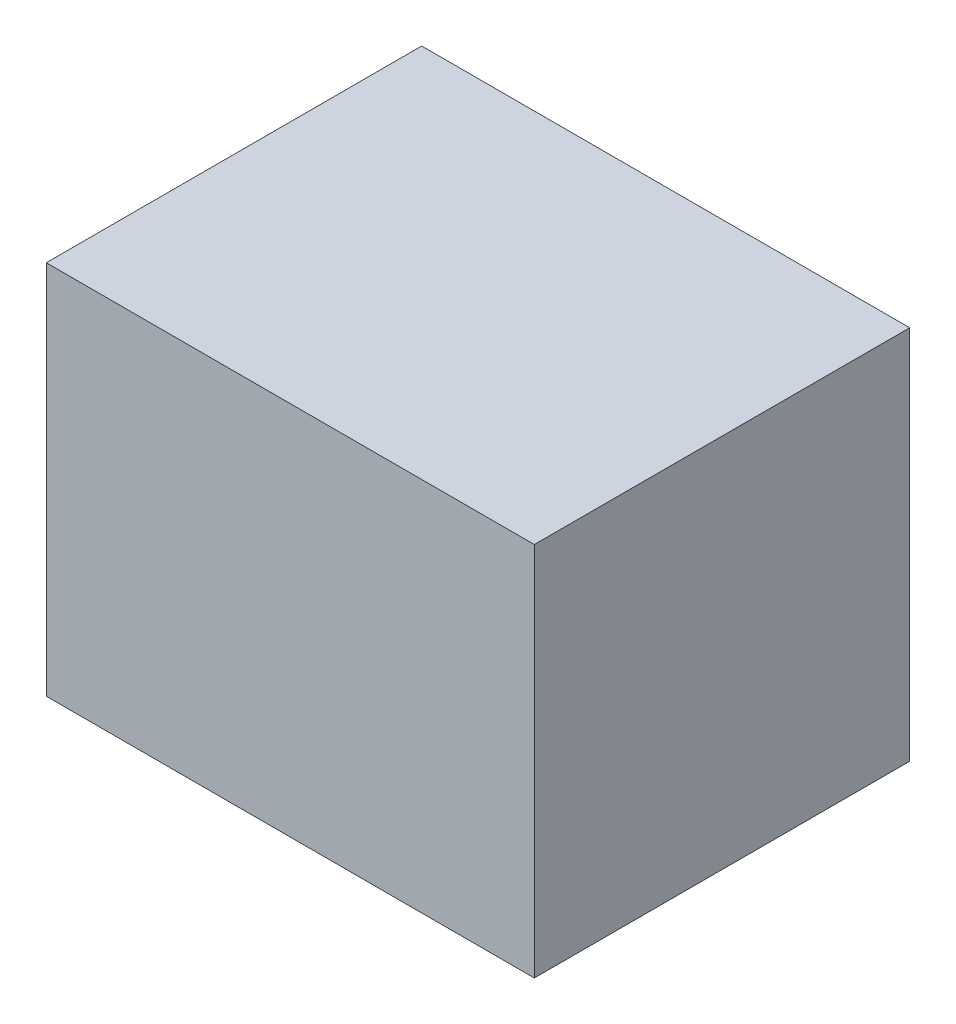
ISO-10303-21;
HEADER;
FILE_DESCRIPTION(('STEP AP214'),'2;1');
FILE_NAME('part.step','',(''),(''),'','','');
FILE_SCHEMA(('AUTOMOTIVE_DESIGN { 1 0 10303 214 1 1 1 1 }'));
ENDSEC;
DATA;
#1=APPLICATION_CONTEXT('core data for automotive mechanical design processes');
#2=APPLICATION_PROTOCOL_DEFINITION('international standard','automotive_design',2000,#1);
#3=PRODUCT_CONTEXT('',#1,'mechanical');
#4=PRODUCT('Part','Part','',(#3));
#5=PRODUCT_RELATED_PRODUCT_CATEGORY('part','',(#4));
#6=PRODUCT_DEFINITION_FORMATION('','',#4);
#7=PRODUCT_DEFINITION_CONTEXT('part definition',#1,'design');
#8=PRODUCT_DEFINITION('design','',#6,#7);
#9=PRODUCT_DEFINITION_SHAPE('','',#8);
#10=(LENGTH_UNIT() NAMED_UNIT(*) SI_UNIT(.MILLI.,.METRE.));
#11=(NAMED_UNIT(*) PLANE_ANGLE_UNIT() SI_UNIT($,.RADIAN.));
#12=(NAMED_UNIT(*) SI_UNIT($,.STERADIAN.) SOLID_ANGLE_UNIT());
#13=UNCERTAINTY_MEASURE_WITH_UNIT(LENGTH_MEASURE(1.E-05),#10,'distance_accuracy_value','');
#14=(GEOMETRIC_REPRESENTATION_CONTEXT(3) GLOBAL_UNCERTAINTY_ASSIGNED_CONTEXT((#13)) GLOBAL_UNIT_ASSIGNED_CONTEXT((#10,
#11,#12)) REPRESENTATION_CONTEXT('',''));
#15=CARTESIAN_POINT('',(0.,0.,0.));
#16=DIRECTION('',(0.,0.,1.));
#17=DIRECTION('',(1.,0.,0.));
#18=AXIS2_PLACEMENT_3D('',#15,#16,#17);
#19=CARTESIAN_POINT('',(325.,500.,-250.));
#20=DIRECTION('',(-1.,0.,0.));
#21=DIRECTION('',(0.,0.,1.));
#22=AXIS2_PLACEMENT_3D('',#19,#20,#21);
#23=PLANE('',#22);
#24=DIRECTION('',(0.,0.,-1.));
#25=VECTOR('',#24,1.);
#26=CARTESIAN_POINT('',(325.,0.,-250.));
#27=LINE('',#26,#25);
#28=CARTESIAN_POINT('',(325.,0.,250.));
#29=VERTEX_POINT('',#28);
#30=CARTESIAN_POINT('',(325.,0.,-250.));
#31=VERTEX_POINT('',#30);
#32=EDGE_CURVE('E96',#29,#31,#27,.T.);
#33=ORIENTED_EDGE('',*,*,#32,.T.);
#34=DIRECTION('',(0.,-1.,0.));
#35=VECTOR('',#34,1.);
#36=CARTESIAN_POINT('',(325.,500.,-250.));
#37=LINE('',#36,#35);
#38=CARTESIAN_POINT('',(325.,500.,-250.));
#39=VERTEX_POINT('',#38);
#40=EDGE_CURVE('E11',#39,#31,#37,.T.);
#41=ORIENTED_EDGE('',*,*,#40,.F.);
#42=DIRECTION('',(0.,0.,-1.));
#43=VECTOR('',#42,1.);
#44=CARTESIAN_POINT('',(325.,500.,-250.));
#45=LINE('',#44,#43);
#46=CARTESIAN_POINT('',(325.,500.,250.));
#47=VERTEX_POINT('',#46);
#48=EDGE_CURVE('E84',#47,#39,#45,.T.);
#49=ORIENTED_EDGE('',*,*,#48,.F.);
#50=DIRECTION('',(0.,-1.,0.));
#51=VECTOR('',#50,1.);
#52=CARTESIAN_POINT('',(325.,500.,250.));
#53=LINE('',#52,#51);
#54=EDGE_CURVE('E92',#47,#29,#53,.T.);
#55=ORIENTED_EDGE('',*,*,#54,.T.);
#56=EDGE_LOOP('',(#33,#41,#49,#55));
#57=FACE_BOUND('',#56,.T.);
#58=ADVANCED_FACE('F33',(#57),#23,.F.);
#59=CARTESIAN_POINT('',(-325.,500.,-250.));
#60=DIRECTION('',(0.,0.,1.));
#61=DIRECTION('',(1.,0.,0.));
#62=AXIS2_PLACEMENT_3D('',#59,#60,#61);
#63=PLANE('',#62);
#64=DIRECTION('',(-1.,0.,0.));
#65=VECTOR('',#64,1.);
#66=CARTESIAN_POINT('',(-325.,0.,-250.));
#67=LINE('',#66,#65);
#68=CARTESIAN_POINT('',(-325.,0.,-250.));
#69=VERTEX_POINT('',#68);
#70=EDGE_CURVE('E88',#31,#69,#67,.T.);
#71=ORIENTED_EDGE('',*,*,#70,.T.);
#72=DIRECTION('',(0.,-1.,0.));
#73=VECTOR('',#72,1.);
#74=CARTESIAN_POINT('',(-325.,500.,-250.));
#75=LINE('',#74,#73);
#76=CARTESIAN_POINT('',(-325.,500.,-250.));
#77=VERTEX_POINT('',#76);
#78=EDGE_CURVE('E41',#77,#69,#75,.T.);
#79=ORIENTED_EDGE('',*,*,#78,.F.);
#80=DIRECTION('',(-1.,0.,0.));
#81=VECTOR('',#80,1.);
#82=CARTESIAN_POINT('',(-325.,500.,-250.));
#83=LINE('',#82,#81);
#84=EDGE_CURVE('E79',#39,#77,#83,.T.);
#85=ORIENTED_EDGE('',*,*,#84,.F.);
#86=ORIENTED_EDGE('',*,*,#40,.T.);
#87=EDGE_LOOP('',(#71,#79,#85,#86));
#88=FACE_BOUND('',#87,.T.);
#89=ADVANCED_FACE('F87',(#88),#63,.F.);
#90=CARTESIAN_POINT('',(-325.,500.,-250.));
#91=DIRECTION('',(1.,0.,0.));
#92=DIRECTION('',(0.,0.,-1.));
#93=AXIS2_PLACEMENT_3D('',#90,#91,#92);
#94=PLANE('',#93);
#95=DIRECTION('',(0.,0.,1.));
#96=VECTOR('',#95,1.);
#97=CARTESIAN_POINT('',(-325.,0.,-250.));
#98=LINE('',#97,#96);
#99=CARTESIAN_POINT('',(-325.,0.,250.));
#100=VERTEX_POINT('',#99);
#101=EDGE_CURVE('E66',#69,#100,#98,.T.);
#102=ORIENTED_EDGE('',*,*,#101,.T.);
#103=DIRECTION('',(0.,-1.,0.));
#104=VECTOR('',#103,1.);
#105=CARTESIAN_POINT('',(-325.,500.,250.));
#106=LINE('',#105,#104);
#107=CARTESIAN_POINT('',(-325.,500.,250.));
#108=VERTEX_POINT('',#107);
#109=EDGE_CURVE('E89',#108,#100,#106,.T.);
#110=ORIENTED_EDGE('',*,*,#109,.F.);
#111=DIRECTION('',(0.,0.,1.));
#112=VECTOR('',#111,1.);
#113=CARTESIAN_POINT('',(-325.,500.,-250.));
#114=LINE('',#113,#112);
#115=EDGE_CURVE('E82',#77,#108,#114,.T.);
#116=ORIENTED_EDGE('',*,*,#115,.F.);
#117=ORIENTED_EDGE('',*,*,#78,.T.);
#118=EDGE_LOOP('',(#102,#110,#116,#117));
#119=FACE_BOUND('',#118,.T.);
#120=ADVANCED_FACE('F90',(#119),#94,.F.);
#121=CARTESIAN_POINT('',(-325.,500.,250.));
#122=DIRECTION('',(0.,0.,-1.));
#123=DIRECTION('',(-1.,0.,0.));
#124=AXIS2_PLACEMENT_3D('',#121,#122,#123);
#125=PLANE('',#124);
#126=DIRECTION('',(1.,0.,0.));
#127=VECTOR('',#126,1.);
#128=CARTESIAN_POINT('',(-325.,0.,250.));
#129=LINE('',#128,#127);
#130=EDGE_CURVE('E72',#100,#29,#129,.T.);
#131=ORIENTED_EDGE('',*,*,#130,.T.);
#132=ORIENTED_EDGE('',*,*,#54,.F.);
#133=DIRECTION('',(1.,0.,0.));
#134=VECTOR('',#133,1.);
#135=CARTESIAN_POINT('',(-325.,500.,250.));
#136=LINE('',#135,#134);
#137=EDGE_CURVE('E49',#108,#47,#136,.T.);
#138=ORIENTED_EDGE('',*,*,#137,.F.);
#139=ORIENTED_EDGE('',*,*,#109,.T.);
#140=EDGE_LOOP('',(#131,#132,#138,#139));
#141=FACE_BOUND('',#140,.T.);
#142=ADVANCED_FACE('F103',(#141),#125,.F.);
#143=CARTESIAN_POINT('',(0.,500.,0.));
#144=DIRECTION('',(0.,1.,0.));
#145=DIRECTION('',(0.,0.,1.));
#146=AXIS2_PLACEMENT_3D('',#143,#144,#145);
#147=PLANE('',#146);
#148=ORIENTED_EDGE('',*,*,#48,.T.);
#149=ORIENTED_EDGE('',*,*,#84,.T.);
#150=ORIENTED_EDGE('',*,*,#115,.T.);
#151=ORIENTED_EDGE('',*,*,#137,.T.);
#152=EDGE_LOOP('',(#148,#149,#150,#151));
#153=FACE_BOUND('',#152,.T.);
#154=ADVANCED_FACE('F80',(#153),#147,.T.);
#155=CARTESIAN_POINT('',(0.,0.,0.));
#156=DIRECTION('',(0.,1.,0.));
#157=DIRECTION('',(0.,0.,1.));
#158=AXIS2_PLACEMENT_3D('',#155,#156,#157);
#159=PLANE('',#158);
#160=ORIENTED_EDGE('',*,*,#32,.F.);
#161=ORIENTED_EDGE('',*,*,#130,.F.);
#162=ORIENTED_EDGE('',*,*,#101,.F.);
#163=ORIENTED_EDGE('',*,*,#70,.F.);
#164=EDGE_LOOP('',(#160,#161,#162,#163));
#165=FACE_BOUND('',#164,.T.);
#166=ADVANCED_FACE('F106',(#165),#159,.F.);
#167=CLOSED_SHELL('',(#58,#89,#120,#142,#154,#166));
#168=MANIFOLD_SOLID_BREP('B2',#167);
#169=ADVANCED_BREP_SHAPE_REPRESENTATION('',(#18,#168),#14);
#170=SHAPE_DEFINITION_REPRESENTATION(#9,#169);
ENDSEC;
END-ISO-10303-21;
